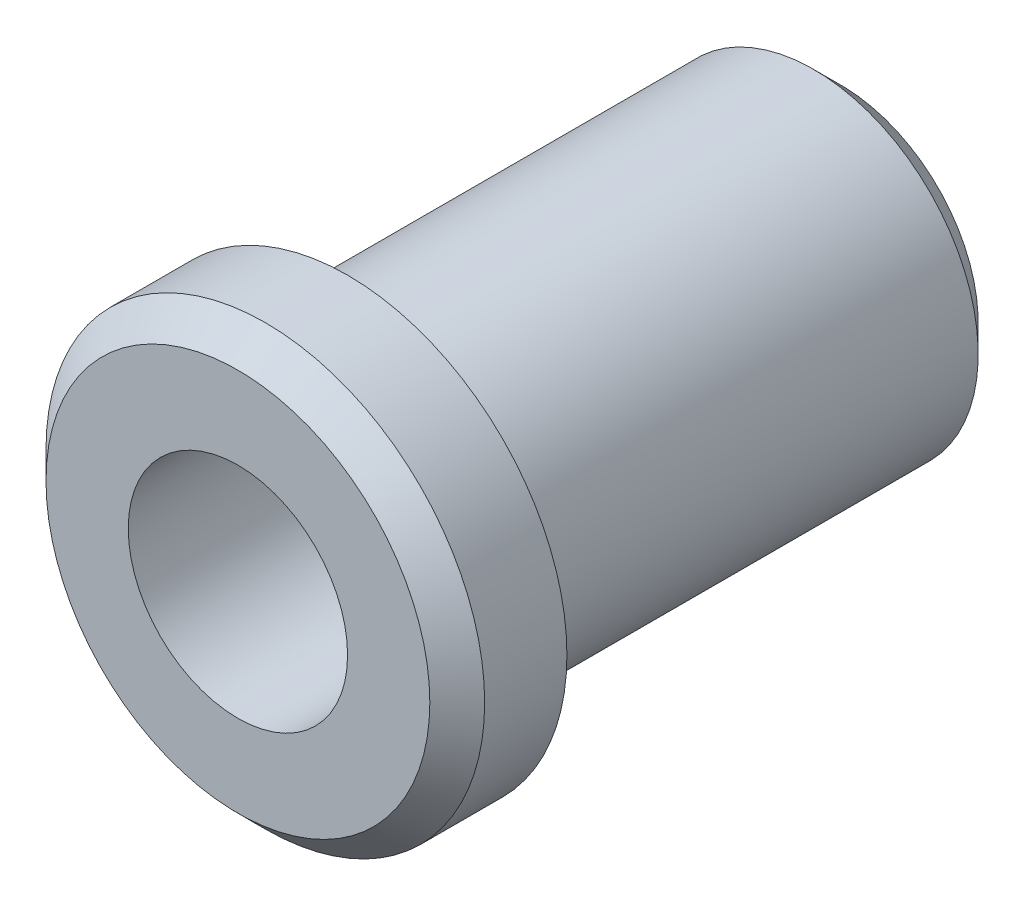
ISO-10303-21;
HEADER;
FILE_DESCRIPTION(('STEP AP214'),'2;1');
FILE_NAME('part.step','',(''),(''),'','','');
FILE_SCHEMA(('AUTOMOTIVE_DESIGN { 1 0 10303 214 1 1 1 1 }'));
ENDSEC;
DATA;
#1=APPLICATION_CONTEXT('core data for automotive mechanical design processes');
#2=APPLICATION_PROTOCOL_DEFINITION('international standard','automotive_design',2000,#1);
#3=PRODUCT_CONTEXT('',#1,'mechanical');
#4=PRODUCT('Part','Part','',(#3));
#5=PRODUCT_RELATED_PRODUCT_CATEGORY('part','',(#4));
#6=PRODUCT_DEFINITION_FORMATION('','',#4);
#7=PRODUCT_DEFINITION_CONTEXT('part definition',#1,'design');
#8=PRODUCT_DEFINITION('design','',#6,#7);
#9=PRODUCT_DEFINITION_SHAPE('','',#8);
#10=(LENGTH_UNIT() NAMED_UNIT(*) SI_UNIT(.MILLI.,.METRE.));
#11=(NAMED_UNIT(*) PLANE_ANGLE_UNIT() SI_UNIT($,.RADIAN.));
#12=(NAMED_UNIT(*) SI_UNIT($,.STERADIAN.) SOLID_ANGLE_UNIT());
#13=UNCERTAINTY_MEASURE_WITH_UNIT(LENGTH_MEASURE(1.E-05),#10,'distance_accuracy_value','');
#14=(GEOMETRIC_REPRESENTATION_CONTEXT(3) GLOBAL_UNCERTAINTY_ASSIGNED_CONTEXT((#13)) GLOBAL_UNIT_ASSIGNED_CONTEXT((#10,
#11,#12)) REPRESENTATION_CONTEXT('',''));
#15=CARTESIAN_POINT('',(0.,0.,0.));
#16=DIRECTION('',(0.,0.,1.));
#17=DIRECTION('',(1.,0.,0.));
#18=AXIS2_PLACEMENT_3D('',#15,#16,#17);
#19=CARTESIAN_POINT('',(0.,0.,4.));
#20=DIRECTION('',(0.,0.,-1.));
#21=DIRECTION('',(-1.,0.,0.));
#22=AXIS2_PLACEMENT_3D('',#19,#20,#21);
#23=CYLINDRICAL_SURFACE('',#22,8.);
#24=CARTESIAN_POINT('',(0.,0.,2.99999999999999));
#25=DIRECTION('',(0.,0.,1.));
#26=DIRECTION('',(1.,0.,0.));
#27=AXIS2_PLACEMENT_3D('',#24,#25,#26);
#28=CIRCLE('',#27,8.);
#29=CARTESIAN_POINT('',(8.,0.,2.99999999999999));
#30=VERTEX_POINT('',#29);
#31=EDGE_CURVE('E50',#30,#30,#28,.F.);
#32=ORIENTED_EDGE('',*,*,#31,.T.);
#33=EDGE_LOOP('',(#32));
#34=FACE_BOUND('',#33,.T.);
#35=CARTESIAN_POINT('',(0.,0.,0.));
#36=DIRECTION('',(0.,0.,1.));
#37=DIRECTION('',(1.,0.,0.));
#38=AXIS2_PLACEMENT_3D('',#35,#36,#37);
#39=CIRCLE('',#38,8.);
#40=CARTESIAN_POINT('',(8.,0.,0.));
#41=VERTEX_POINT('',#40);
#42=EDGE_CURVE('E62',#41,#41,#39,.T.);
#43=ORIENTED_EDGE('',*,*,#42,.T.);
#44=EDGE_LOOP('',(#43));
#45=FACE_BOUND('',#44,.T.);
#46=ADVANCED_FACE('F37',(#34,#45),#23,.T.);
#47=CARTESIAN_POINT('',(0.,0.,4.));
#48=DIRECTION('',(0.,0.,1.));
#49=DIRECTION('',(1.,0.,0.));
#50=AXIS2_PLACEMENT_3D('',#47,#48,#49);
#51=PLANE('',#50);
#52=CARTESIAN_POINT('',(0.,0.,4.));
#53=DIRECTION('',(0.,0.,1.));
#54=DIRECTION('',(1.,0.,0.));
#55=AXIS2_PLACEMENT_3D('',#52,#53,#54);
#56=CIRCLE('',#55,6.99999999999999);
#57=CARTESIAN_POINT('',(6.99999999999999,0.,4.));
#58=VERTEX_POINT('',#57);
#59=EDGE_CURVE('E55',#58,#58,#56,.T.);
#60=ORIENTED_EDGE('',*,*,#59,.T.);
#61=EDGE_LOOP('',(#60));
#62=FACE_BOUND('',#61,.T.);
#63=CARTESIAN_POINT('',(0.,0.,4.));
#64=DIRECTION('',(0.,0.,-1.));
#65=DIRECTION('',(-1.,0.,0.));
#66=AXIS2_PLACEMENT_3D('',#63,#64,#65);
#67=CIRCLE('',#66,4.);
#68=CARTESIAN_POINT('',(-4.,0.,4.));
#69=VERTEX_POINT('',#68);
#70=EDGE_CURVE('E66',#69,#69,#67,.T.);
#71=ORIENTED_EDGE('',*,*,#70,.T.);
#72=EDGE_LOOP('',(#71));
#73=FACE_BOUND('',#72,.T.);
#74=ADVANCED_FACE('F78',(#62,#73),#51,.T.);
#75=CARTESIAN_POINT('',(0.,0.,0.));
#76=DIRECTION('',(0.,0.,1.));
#77=DIRECTION('',(1.,0.,0.));
#78=AXIS2_PLACEMENT_3D('',#75,#76,#77);
#79=PLANE('',#78);
#80=CARTESIAN_POINT('',(0.,0.,0.));
#81=DIRECTION('',(0.,0.,-1.));
#82=DIRECTION('',(-1.,0.,0.));
#83=AXIS2_PLACEMENT_3D('',#80,#81,#82);
#84=CIRCLE('',#83,6.);
#85=CARTESIAN_POINT('',(-6.,0.,0.));
#86=VERTEX_POINT('',#85);
#87=EDGE_CURVE('E61',#86,#86,#84,.T.);
#88=ORIENTED_EDGE('',*,*,#87,.F.);
#89=EDGE_LOOP('',(#88));
#90=FACE_BOUND('',#89,.T.);
#91=ORIENTED_EDGE('',*,*,#42,.F.);
#92=EDGE_LOOP('',(#91));
#93=FACE_BOUND('',#92,.T.);
#94=ADVANCED_FACE('F94',(#90,#93),#79,.F.);
#95=CARTESIAN_POINT('',(0.,0.,-18.));
#96=DIRECTION('',(0.,0.,1.));
#97=DIRECTION('',(1.,0.,0.));
#98=AXIS2_PLACEMENT_3D('',#95,#96,#97);
#99=CYLINDRICAL_SURFACE('',#98,6.);
#100=CARTESIAN_POINT('',(0.,0.,-17.));
#101=DIRECTION('',(0.,0.,-1.));
#102=DIRECTION('',(-1.,0.,0.));
#103=AXIS2_PLACEMENT_3D('',#100,#101,#102);
#104=CIRCLE('',#103,6.);
#105=CARTESIAN_POINT('',(-6.,0.,-17.));
#106=VERTEX_POINT('',#105);
#107=EDGE_CURVE('E10',#106,#106,#104,.F.);
#108=ORIENTED_EDGE('',*,*,#107,.T.);
#109=EDGE_LOOP('',(#108));
#110=FACE_BOUND('',#109,.T.);
#111=ORIENTED_EDGE('',*,*,#87,.T.);
#112=EDGE_LOOP('',(#111));
#113=FACE_BOUND('',#112,.T.);
#114=ADVANCED_FACE('F89',(#110,#113),#99,.T.);
#115=CARTESIAN_POINT('',(0.,0.,-18.));
#116=DIRECTION('',(0.,0.,-1.));
#117=DIRECTION('',(-1.,0.,0.));
#118=AXIS2_PLACEMENT_3D('',#115,#116,#117);
#119=PLANE('',#118);
#120=CARTESIAN_POINT('',(0.,0.,-18.));
#121=DIRECTION('',(0.,0.,-1.));
#122=DIRECTION('',(-1.,0.,0.));
#123=AXIS2_PLACEMENT_3D('',#120,#121,#122);
#124=CIRCLE('',#123,5.);
#125=CARTESIAN_POINT('',(-5.,0.,-18.));
#126=VERTEX_POINT('',#125);
#127=EDGE_CURVE('E45',#126,#126,#124,.T.);
#128=ORIENTED_EDGE('',*,*,#127,.T.);
#129=EDGE_LOOP('',(#128));
#130=FACE_BOUND('',#129,.T.);
#131=CARTESIAN_POINT('',(0.,0.,-18.));
#132=DIRECTION('',(0.,0.,-1.));
#133=DIRECTION('',(-1.,0.,0.));
#134=AXIS2_PLACEMENT_3D('',#131,#132,#133);
#135=CIRCLE('',#134,4.);
#136=CARTESIAN_POINT('',(-4.,0.,-18.));
#137=VERTEX_POINT('',#136);
#138=EDGE_CURVE('E70',#137,#137,#135,.T.);
#139=ORIENTED_EDGE('',*,*,#138,.F.);
#140=EDGE_LOOP('',(#139));
#141=FACE_BOUND('',#140,.T.);
#142=ADVANCED_FACE('F84',(#130,#141),#119,.T.);
#143=CARTESIAN_POINT('',(0.,0.,4.));
#144=DIRECTION('',(0.,0.,-1.));
#145=DIRECTION('',(-1.,0.,0.));
#146=AXIS2_PLACEMENT_3D('',#143,#144,#145);
#147=CYLINDRICAL_SURFACE('',#146,4.);
#148=ORIENTED_EDGE('',*,*,#70,.F.);
#149=EDGE_LOOP('',(#148));
#150=FACE_BOUND('',#149,.T.);
#151=ORIENTED_EDGE('',*,*,#138,.T.);
#152=EDGE_LOOP('',(#151));
#153=FACE_BOUND('',#152,.T.);
#154=ADVANCED_FACE('F80',(#150,#153),#147,.F.);
#155=CARTESIAN_POINT('',(0.,0.,4.));
#156=DIRECTION('',(0.,0.,-1.));
#157=DIRECTION('',(-1.,0.,0.));
#158=AXIS2_PLACEMENT_3D('',#155,#156,#157);
#159=CONICAL_SURFACE('',#158,6.99999999999999,0.785398163397448);
#160=ORIENTED_EDGE('',*,*,#31,.F.);
#161=EDGE_LOOP('',(#160));
#162=FACE_BOUND('',#161,.T.);
#163=ORIENTED_EDGE('',*,*,#59,.F.);
#164=EDGE_LOOP('',(#163));
#165=FACE_BOUND('',#164,.T.);
#166=ADVANCED_FACE('F83',(#162,#165),#159,.T.);
#167=CARTESIAN_POINT('',(0.,0.,-18.));
#168=DIRECTION('',(0.,0.,1.));
#169=DIRECTION('',(1.,0.,0.));
#170=AXIS2_PLACEMENT_3D('',#167,#168,#169);
#171=CONICAL_SURFACE('',#170,5.,0.785398163397446);
#172=ORIENTED_EDGE('',*,*,#107,.F.);
#173=EDGE_LOOP('',(#172));
#174=FACE_BOUND('',#173,.T.);
#175=ORIENTED_EDGE('',*,*,#127,.F.);
#176=EDGE_LOOP('',(#175));
#177=FACE_BOUND('',#176,.T.);
#178=ADVANCED_FACE('F39',(#174,#177),#171,.T.);
#179=CLOSED_SHELL('',(#46,#74,#94,#114,#142,#154,#166,#178));
#180=MANIFOLD_SOLID_BREP('B2',#179);
#181=ADVANCED_BREP_SHAPE_REPRESENTATION('',(#18,#180),#14);
#182=SHAPE_DEFINITION_REPRESENTATION(#9,#181);
ENDSEC;
END-ISO-10303-21;
